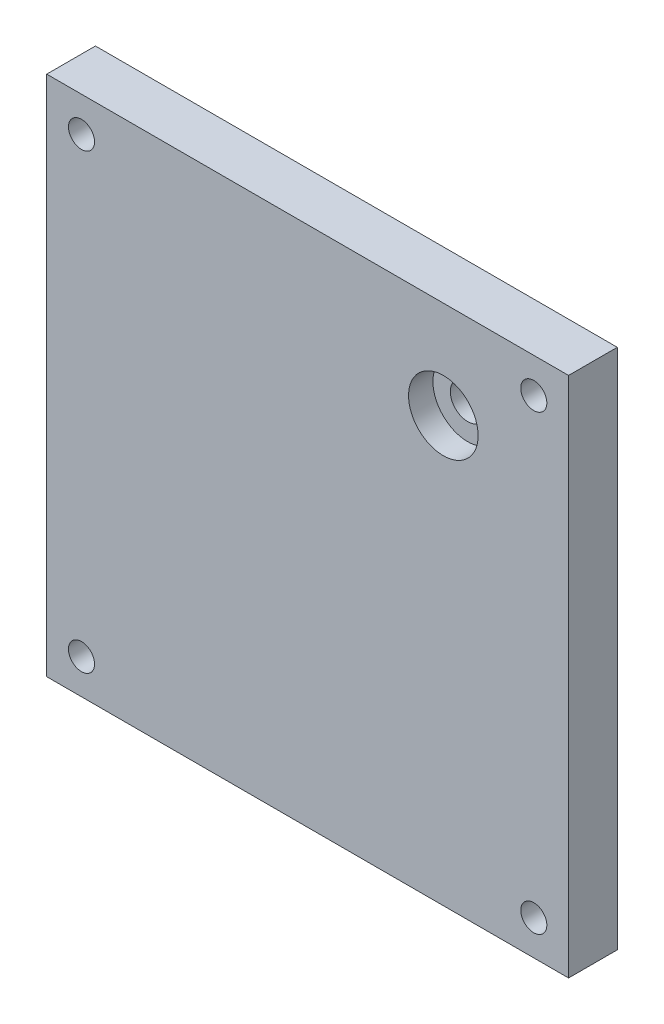
ISO-10303-21;
HEADER;
FILE_DESCRIPTION(('STEP AP214'),'2;1');
FILE_NAME('part.step','',(''),(''),'','','');
FILE_SCHEMA(('AUTOMOTIVE_DESIGN { 1 0 10303 214 1 1 1 1 }'));
ENDSEC;
DATA;
#1=APPLICATION_CONTEXT('core data for automotive mechanical design processes');
#2=APPLICATION_PROTOCOL_DEFINITION('international standard','automotive_design',2000,#1);
#3=PRODUCT_CONTEXT('',#1,'mechanical');
#4=PRODUCT('Part','Part','',(#3));
#5=PRODUCT_RELATED_PRODUCT_CATEGORY('part','',(#4));
#6=PRODUCT_DEFINITION_FORMATION('','',#4);
#7=PRODUCT_DEFINITION_CONTEXT('part definition',#1,'design');
#8=PRODUCT_DEFINITION('design','',#6,#7);
#9=PRODUCT_DEFINITION_SHAPE('','',#8);
#10=(LENGTH_UNIT() NAMED_UNIT(*) SI_UNIT(.MILLI.,.METRE.));
#11=(NAMED_UNIT(*) PLANE_ANGLE_UNIT() SI_UNIT($,.RADIAN.));
#12=(NAMED_UNIT(*) SI_UNIT($,.STERADIAN.) SOLID_ANGLE_UNIT());
#13=UNCERTAINTY_MEASURE_WITH_UNIT(LENGTH_MEASURE(1.E-05),#10,'distance_accuracy_value','');
#14=(GEOMETRIC_REPRESENTATION_CONTEXT(3) GLOBAL_UNCERTAINTY_ASSIGNED_CONTEXT((#13)) GLOBAL_UNIT_ASSIGNED_CONTEXT((#10,
#11,#12)) REPRESENTATION_CONTEXT('',''));
#15=CARTESIAN_POINT('',(0.,0.,0.));
#16=DIRECTION('',(0.,0.,1.));
#17=DIRECTION('',(1.,0.,0.));
#18=AXIS2_PLACEMENT_3D('',#15,#16,#17);
#19=CARTESIAN_POINT('',(47.625,-47.625,8.89));
#20=DIRECTION('',(-1.,0.,0.));
#21=DIRECTION('',(0.,0.,1.));
#22=AXIS2_PLACEMENT_3D('',#19,#20,#21);
#23=PLANE('',#22);
#24=DIRECTION('',(0.,1.,0.));
#25=VECTOR('',#24,1.);
#26=CARTESIAN_POINT('',(47.625,-47.625,0.));
#27=LINE('',#26,#25);
#28=CARTESIAN_POINT('',(47.625,-47.625,0.));
#29=VERTEX_POINT('',#28);
#30=CARTESIAN_POINT('',(47.625,47.625,0.));
#31=VERTEX_POINT('',#30);
#32=EDGE_CURVE('E108',#29,#31,#27,.T.);
#33=ORIENTED_EDGE('',*,*,#32,.T.);
#34=DIRECTION('',(0.,0.,-1.));
#35=VECTOR('',#34,1.);
#36=CARTESIAN_POINT('',(47.625,47.625,8.89));
#37=LINE('',#36,#35);
#38=CARTESIAN_POINT('',(47.625,47.625,8.89));
#39=VERTEX_POINT('',#38);
#40=EDGE_CURVE('E12',#39,#31,#37,.T.);
#41=ORIENTED_EDGE('',*,*,#40,.F.);
#42=DIRECTION('',(0.,1.,0.));
#43=VECTOR('',#42,1.);
#44=CARTESIAN_POINT('',(47.625,-47.625,8.89));
#45=LINE('',#44,#43);
#46=CARTESIAN_POINT('',(47.625,-47.625,8.89));
#47=VERTEX_POINT('',#46);
#48=EDGE_CURVE('E92',#47,#39,#45,.T.);
#49=ORIENTED_EDGE('',*,*,#48,.F.);
#50=DIRECTION('',(0.,0.,-1.));
#51=VECTOR('',#50,1.);
#52=CARTESIAN_POINT('',(47.625,-47.625,8.89));
#53=LINE('',#52,#51);
#54=EDGE_CURVE('E104',#47,#29,#53,.T.);
#55=ORIENTED_EDGE('',*,*,#54,.T.);
#56=EDGE_LOOP('',(#33,#41,#49,#55));
#57=FACE_BOUND('',#56,.T.);
#58=ADVANCED_FACE('F40',(#57),#23,.F.);
#59=CARTESIAN_POINT('',(-47.625,47.625,8.89));
#60=DIRECTION('',(0.,-1.,0.));
#61=DIRECTION('',(0.,0.,-1.));
#62=AXIS2_PLACEMENT_3D('',#59,#60,#61);
#63=PLANE('',#62);
#64=DIRECTION('',(-1.,0.,0.));
#65=VECTOR('',#64,1.);
#66=CARTESIAN_POINT('',(-47.625,47.625,0.));
#67=LINE('',#66,#65);
#68=CARTESIAN_POINT('',(-47.625,47.625,0.));
#69=VERTEX_POINT('',#68);
#70=EDGE_CURVE('E97',#31,#69,#67,.T.);
#71=ORIENTED_EDGE('',*,*,#70,.T.);
#72=DIRECTION('',(0.,0.,-1.));
#73=VECTOR('',#72,1.);
#74=CARTESIAN_POINT('',(-47.625,47.625,8.89));
#75=LINE('',#74,#73);
#76=CARTESIAN_POINT('',(-47.625,47.625,8.89));
#77=VERTEX_POINT('',#76);
#78=EDGE_CURVE('E49',#77,#69,#75,.T.);
#79=ORIENTED_EDGE('',*,*,#78,.F.);
#80=DIRECTION('',(-1.,0.,0.));
#81=VECTOR('',#80,1.);
#82=CARTESIAN_POINT('',(-47.625,47.625,8.89));
#83=LINE('',#82,#81);
#84=EDGE_CURVE('E87',#39,#77,#83,.T.);
#85=ORIENTED_EDGE('',*,*,#84,.F.);
#86=ORIENTED_EDGE('',*,*,#40,.T.);
#87=EDGE_LOOP('',(#71,#79,#85,#86));
#88=FACE_BOUND('',#87,.T.);
#89=ADVANCED_FACE('F96',(#88),#63,.F.);
#90=CARTESIAN_POINT('',(-47.625,-47.625,8.89));
#91=DIRECTION('',(1.,0.,0.));
#92=DIRECTION('',(0.,0.,-1.));
#93=AXIS2_PLACEMENT_3D('',#90,#91,#92);
#94=PLANE('',#93);
#95=DIRECTION('',(0.,-1.,0.));
#96=VECTOR('',#95,1.);
#97=CARTESIAN_POINT('',(-47.625,-47.625,0.));
#98=LINE('',#97,#96);
#99=CARTESIAN_POINT('',(-47.625,-47.625,0.));
#100=VERTEX_POINT('',#99);
#101=EDGE_CURVE('E74',#69,#100,#98,.T.);
#102=ORIENTED_EDGE('',*,*,#101,.T.);
#103=DIRECTION('',(0.,0.,-1.));
#104=VECTOR('',#103,1.);
#105=CARTESIAN_POINT('',(-47.625,-47.625,8.89));
#106=LINE('',#105,#104);
#107=CARTESIAN_POINT('',(-47.625,-47.625,8.89));
#108=VERTEX_POINT('',#107);
#109=EDGE_CURVE('E99',#108,#100,#106,.T.);
#110=ORIENTED_EDGE('',*,*,#109,.F.);
#111=DIRECTION('',(0.,-1.,0.));
#112=VECTOR('',#111,1.);
#113=CARTESIAN_POINT('',(-47.625,-47.625,8.89));
#114=LINE('',#113,#112);
#115=EDGE_CURVE('E90',#77,#108,#114,.T.);
#116=ORIENTED_EDGE('',*,*,#115,.F.);
#117=ORIENTED_EDGE('',*,*,#78,.T.);
#118=EDGE_LOOP('',(#102,#110,#116,#117));
#119=FACE_BOUND('',#118,.T.);
#120=ADVANCED_FACE('F100',(#119),#94,.F.);
#121=CARTESIAN_POINT('',(-47.625,-47.625,8.89));
#122=DIRECTION('',(0.,1.,0.));
#123=DIRECTION('',(0.,0.,1.));
#124=AXIS2_PLACEMENT_3D('',#121,#122,#123);
#125=PLANE('',#124);
#126=DIRECTION('',(1.,0.,0.));
#127=VECTOR('',#126,1.);
#128=CARTESIAN_POINT('',(-47.625,-47.625,0.));
#129=LINE('',#128,#127);
#130=EDGE_CURVE('E80',#100,#29,#129,.T.);
#131=ORIENTED_EDGE('',*,*,#130,.T.);
#132=ORIENTED_EDGE('',*,*,#54,.F.);
#133=DIRECTION('',(1.,0.,0.));
#134=VECTOR('',#133,1.);
#135=CARTESIAN_POINT('',(-47.625,-47.625,8.89));
#136=LINE('',#135,#134);
#137=EDGE_CURVE('E57',#108,#47,#136,.T.);
#138=ORIENTED_EDGE('',*,*,#137,.F.);
#139=ORIENTED_EDGE('',*,*,#109,.T.);
#140=EDGE_LOOP('',(#131,#132,#138,#139));
#141=FACE_BOUND('',#140,.T.);
#142=ADVANCED_FACE('F122',(#141),#125,.F.);
#143=CARTESIAN_POINT('',(0.,0.,8.89));
#144=DIRECTION('',(0.,0.,-1.));
#145=DIRECTION('',(-1.,0.,0.));
#146=AXIS2_PLACEMENT_3D('',#143,#144,#145);
#147=PLANE('',#146);
#148=CARTESIAN_POINT('',(24.765,29.845,8.89));
#149=DIRECTION('',(0.,0.,1.));
#150=DIRECTION('',(1.,0.,0.));
#151=AXIS2_PLACEMENT_3D('',#148,#149,#150);
#152=CIRCLE('',#151,6.35);
#153=CARTESIAN_POINT('',(31.115,29.845,8.89));
#154=VERTEX_POINT('',#153);
#155=EDGE_CURVE('E161',#154,#154,#152,.T.);
#156=ORIENTED_EDGE('',*,*,#155,.F.);
#157=EDGE_LOOP('',(#156));
#158=FACE_BOUND('',#157,.T.);
#159=CARTESIAN_POINT('',(41.275,-41.275,8.89));
#160=DIRECTION('',(0.,0.,1.));
#161=DIRECTION('',(1.,0.,0.));
#162=AXIS2_PLACEMENT_3D('',#159,#160,#161);
#163=CIRCLE('',#162,2.38125);
#164=CARTESIAN_POINT('',(43.65625,-41.275,8.89));
#165=VERTEX_POINT('',#164);
#166=EDGE_CURVE('E146',#165,#165,#163,.T.);
#167=ORIENTED_EDGE('',*,*,#166,.F.);
#168=EDGE_LOOP('',(#167));
#169=FACE_BOUND('',#168,.T.);
#170=CARTESIAN_POINT('',(-41.275,-41.275,8.89));
#171=DIRECTION('',(0.,0.,1.));
#172=DIRECTION('',(1.,0.,0.));
#173=AXIS2_PLACEMENT_3D('',#170,#171,#172);
#174=CIRCLE('',#173,2.38125);
#175=CARTESIAN_POINT('',(-38.89375,-41.275,8.89));
#176=VERTEX_POINT('',#175);
#177=EDGE_CURVE('E137',#176,#176,#174,.T.);
#178=ORIENTED_EDGE('',*,*,#177,.F.);
#179=EDGE_LOOP('',(#178));
#180=FACE_BOUND('',#179,.T.);
#181=CARTESIAN_POINT('',(-41.275,41.275,8.89));
#182=DIRECTION('',(0.,0.,1.));
#183=DIRECTION('',(1.,0.,0.));
#184=AXIS2_PLACEMENT_3D('',#181,#182,#183);
#185=CIRCLE('',#184,2.38125);
#186=CARTESIAN_POINT('',(-38.89375,41.275,8.89));
#187=VERTEX_POINT('',#186);
#188=EDGE_CURVE('E153',#187,#187,#185,.T.);
#189=ORIENTED_EDGE('',*,*,#188,.F.);
#190=EDGE_LOOP('',(#189));
#191=FACE_BOUND('',#190,.T.);
#192=CARTESIAN_POINT('',(41.275,41.275,8.89));
#193=DIRECTION('',(0.,0.,1.));
#194=DIRECTION('',(1.,0.,0.));
#195=AXIS2_PLACEMENT_3D('',#192,#193,#194);
#196=CIRCLE('',#195,2.38125);
#197=CARTESIAN_POINT('',(43.65625,41.275,8.89));
#198=VERTEX_POINT('',#197);
#199=EDGE_CURVE('E129',#198,#198,#196,.T.);
#200=ORIENTED_EDGE('',*,*,#199,.F.);
#201=EDGE_LOOP('',(#200));
#202=FACE_BOUND('',#201,.T.);
#203=ORIENTED_EDGE('',*,*,#48,.T.);
#204=ORIENTED_EDGE('',*,*,#84,.T.);
#205=ORIENTED_EDGE('',*,*,#115,.T.);
#206=ORIENTED_EDGE('',*,*,#137,.T.);
#207=EDGE_LOOP('',(#203,#204,#205,#206));
#208=FACE_BOUND('',#207,.T.);
#209=ADVANCED_FACE('F88',(#158,#169,#180,#191,#202,#208),#147,.F.);
#210=CARTESIAN_POINT('',(0.,0.,0.));
#211=DIRECTION('',(0.,0.,-1.));
#212=DIRECTION('',(-1.,0.,0.));
#213=AXIS2_PLACEMENT_3D('',#210,#211,#212);
#214=PLANE('',#213);
#215=CARTESIAN_POINT('',(24.765,29.845,0.));
#216=DIRECTION('',(0.,0.,1.));
#217=DIRECTION('',(1.,0.,0.));
#218=AXIS2_PLACEMENT_3D('',#215,#216,#217);
#219=CIRCLE('',#218,3.175);
#220=CARTESIAN_POINT('',(27.94,29.845,0.));
#221=VERTEX_POINT('',#220);
#222=EDGE_CURVE('E165',#221,#221,#219,.T.);
#223=ORIENTED_EDGE('',*,*,#222,.T.);
#224=EDGE_LOOP('',(#223));
#225=FACE_BOUND('',#224,.T.);
#226=CARTESIAN_POINT('',(41.275,-41.275,0.));
#227=DIRECTION('',(0.,0.,1.));
#228=DIRECTION('',(1.,0.,0.));
#229=AXIS2_PLACEMENT_3D('',#226,#227,#228);
#230=CIRCLE('',#229,2.38125);
#231=CARTESIAN_POINT('',(43.65625,-41.275,0.));
#232=VERTEX_POINT('',#231);
#233=EDGE_CURVE('E133',#232,#232,#230,.T.);
#234=ORIENTED_EDGE('',*,*,#233,.T.);
#235=EDGE_LOOP('',(#234));
#236=FACE_BOUND('',#235,.T.);
#237=CARTESIAN_POINT('',(-41.275,-41.275,0.));
#238=DIRECTION('',(0.,0.,1.));
#239=DIRECTION('',(1.,0.,0.));
#240=AXIS2_PLACEMENT_3D('',#237,#238,#239);
#241=CIRCLE('',#240,2.38125);
#242=CARTESIAN_POINT('',(-38.89375,-41.275,0.));
#243=VERTEX_POINT('',#242);
#244=EDGE_CURVE('E141',#243,#243,#241,.T.);
#245=ORIENTED_EDGE('',*,*,#244,.T.);
#246=EDGE_LOOP('',(#245));
#247=FACE_BOUND('',#246,.T.);
#248=CARTESIAN_POINT('',(-41.275,41.275,0.));
#249=DIRECTION('',(0.,0.,1.));
#250=DIRECTION('',(1.,0.,0.));
#251=AXIS2_PLACEMENT_3D('',#248,#249,#250);
#252=CIRCLE('',#251,2.38125);
#253=CARTESIAN_POINT('',(-38.89375,41.275,0.));
#254=VERTEX_POINT('',#253);
#255=EDGE_CURVE('E142',#254,#254,#252,.T.);
#256=ORIENTED_EDGE('',*,*,#255,.T.);
#257=EDGE_LOOP('',(#256));
#258=FACE_BOUND('',#257,.T.);
#259=CARTESIAN_POINT('',(41.275,41.275,0.));
#260=DIRECTION('',(0.,0.,1.));
#261=DIRECTION('',(1.,0.,0.));
#262=AXIS2_PLACEMENT_3D('',#259,#260,#261);
#263=CIRCLE('',#262,2.38125);
#264=CARTESIAN_POINT('',(43.65625,41.275,0.));
#265=VERTEX_POINT('',#264);
#266=EDGE_CURVE('E112',#265,#265,#263,.T.);
#267=ORIENTED_EDGE('',*,*,#266,.T.);
#268=EDGE_LOOP('',(#267));
#269=FACE_BOUND('',#268,.T.);
#270=ORIENTED_EDGE('',*,*,#32,.F.);
#271=ORIENTED_EDGE('',*,*,#130,.F.);
#272=ORIENTED_EDGE('',*,*,#101,.F.);
#273=ORIENTED_EDGE('',*,*,#70,.F.);
#274=EDGE_LOOP('',(#270,#271,#272,#273));
#275=FACE_BOUND('',#274,.T.);
#276=ADVANCED_FACE('F125',(#225,#236,#247,#258,#269,#275),#214,.T.);
#277=CARTESIAN_POINT('',(41.275,41.275,0.));
#278=DIRECTION('',(0.,0.,1.));
#279=DIRECTION('',(1.,0.,0.));
#280=AXIS2_PLACEMENT_3D('',#277,#278,#279);
#281=CYLINDRICAL_SURFACE('',#280,2.38125);
#282=ORIENTED_EDGE('',*,*,#266,.F.);
#283=EDGE_LOOP('',(#282));
#284=FACE_BOUND('',#283,.T.);
#285=ORIENTED_EDGE('',*,*,#199,.T.);
#286=EDGE_LOOP('',(#285));
#287=FACE_BOUND('',#286,.T.);
#288=ADVANCED_FACE('F209',(#284,#287),#281,.F.);
#289=CARTESIAN_POINT('',(-41.275,41.275,0.));
#290=DIRECTION('',(0.,0.,1.));
#291=DIRECTION('',(1.,0.,0.));
#292=AXIS2_PLACEMENT_3D('',#289,#290,#291);
#293=CYLINDRICAL_SURFACE('',#292,2.38125);
#294=ORIENTED_EDGE('',*,*,#255,.F.);
#295=EDGE_LOOP('',(#294));
#296=FACE_BOUND('',#295,.T.);
#297=ORIENTED_EDGE('',*,*,#188,.T.);
#298=EDGE_LOOP('',(#297));
#299=FACE_BOUND('',#298,.T.);
#300=ADVANCED_FACE('F211',(#296,#299),#293,.F.);
#301=CARTESIAN_POINT('',(-41.275,-41.275,0.));
#302=DIRECTION('',(0.,0.,1.));
#303=DIRECTION('',(1.,0.,0.));
#304=AXIS2_PLACEMENT_3D('',#301,#302,#303);
#305=CYLINDRICAL_SURFACE('',#304,2.38125);
#306=ORIENTED_EDGE('',*,*,#244,.F.);
#307=EDGE_LOOP('',(#306));
#308=FACE_BOUND('',#307,.T.);
#309=ORIENTED_EDGE('',*,*,#177,.T.);
#310=EDGE_LOOP('',(#309));
#311=FACE_BOUND('',#310,.T.);
#312=ADVANCED_FACE('F218',(#308,#311),#305,.F.);
#313=CARTESIAN_POINT('',(41.275,-41.275,0.));
#314=DIRECTION('',(0.,0.,1.));
#315=DIRECTION('',(1.,0.,0.));
#316=AXIS2_PLACEMENT_3D('',#313,#314,#315);
#317=CYLINDRICAL_SURFACE('',#316,2.38125);
#318=ORIENTED_EDGE('',*,*,#233,.F.);
#319=EDGE_LOOP('',(#318));
#320=FACE_BOUND('',#319,.T.);
#321=ORIENTED_EDGE('',*,*,#166,.T.);
#322=EDGE_LOOP('',(#321));
#323=FACE_BOUND('',#322,.T.);
#324=ADVANCED_FACE('F194',(#320,#323),#317,.F.);
#325=CARTESIAN_POINT('',(24.765,29.845,4.445));
#326=DIRECTION('',(0.,0.,1.));
#327=DIRECTION('',(1.,0.,0.));
#328=AXIS2_PLACEMENT_3D('',#325,#326,#327);
#329=CYLINDRICAL_SURFACE('',#328,6.35);
#330=CARTESIAN_POINT('',(24.765,29.845,4.445));
#331=DIRECTION('',(0.,0.,1.));
#332=DIRECTION('',(1.,0.,0.));
#333=AXIS2_PLACEMENT_3D('',#330,#331,#332);
#334=CIRCLE('',#333,6.35);
#335=CARTESIAN_POINT('',(31.115,29.845,4.445));
#336=VERTEX_POINT('',#335);
#337=EDGE_CURVE('E157',#336,#336,#334,.T.);
#338=ORIENTED_EDGE('',*,*,#337,.F.);
#339=EDGE_LOOP('',(#338));
#340=FACE_BOUND('',#339,.T.);
#341=ORIENTED_EDGE('',*,*,#155,.T.);
#342=EDGE_LOOP('',(#341));
#343=FACE_BOUND('',#342,.T.);
#344=ADVANCED_FACE('F188',(#340,#343),#329,.F.);
#345=CARTESIAN_POINT('',(24.765,29.845,4.445));
#346=DIRECTION('',(0.,0.,1.));
#347=DIRECTION('',(1.,0.,0.));
#348=AXIS2_PLACEMENT_3D('',#345,#346,#347);
#349=PLANE('',#348);
#350=CARTESIAN_POINT('',(24.765,29.845,4.445));
#351=DIRECTION('',(0.,0.,1.));
#352=DIRECTION('',(1.,0.,0.));
#353=AXIS2_PLACEMENT_3D('',#350,#351,#352);
#354=CIRCLE('',#353,3.175);
#355=CARTESIAN_POINT('',(27.94,29.845,4.445));
#356=VERTEX_POINT('',#355);
#357=EDGE_CURVE('E169',#356,#356,#354,.T.);
#358=ORIENTED_EDGE('',*,*,#357,.F.);
#359=EDGE_LOOP('',(#358));
#360=FACE_BOUND('',#359,.T.);
#361=ORIENTED_EDGE('',*,*,#337,.T.);
#362=EDGE_LOOP('',(#361));
#363=FACE_BOUND('',#362,.T.);
#364=ADVANCED_FACE('F182',(#360,#363),#349,.T.);
#365=CARTESIAN_POINT('',(24.765,29.845,0.));
#366=DIRECTION('',(0.,0.,1.));
#367=DIRECTION('',(1.,0.,0.));
#368=AXIS2_PLACEMENT_3D('',#365,#366,#367);
#369=CYLINDRICAL_SURFACE('',#368,3.175);
#370=ORIENTED_EDGE('',*,*,#222,.F.);
#371=EDGE_LOOP('',(#370));
#372=FACE_BOUND('',#371,.T.);
#373=ORIENTED_EDGE('',*,*,#357,.T.);
#374=EDGE_LOOP('',(#373));
#375=FACE_BOUND('',#374,.T.);
#376=ADVANCED_FACE('F179',(#372,#375),#369,.F.);
#377=CLOSED_SHELL('',(#58,#89,#120,#142,#209,#276,#288,#300,#312,#324,#344,#364,#376));
#378=MANIFOLD_SOLID_BREP('B2',#377);
#379=ADVANCED_BREP_SHAPE_REPRESENTATION('',(#18,#378),#14);
#380=SHAPE_DEFINITION_REPRESENTATION(#9,#379);
ENDSEC;
END-ISO-10303-21;
